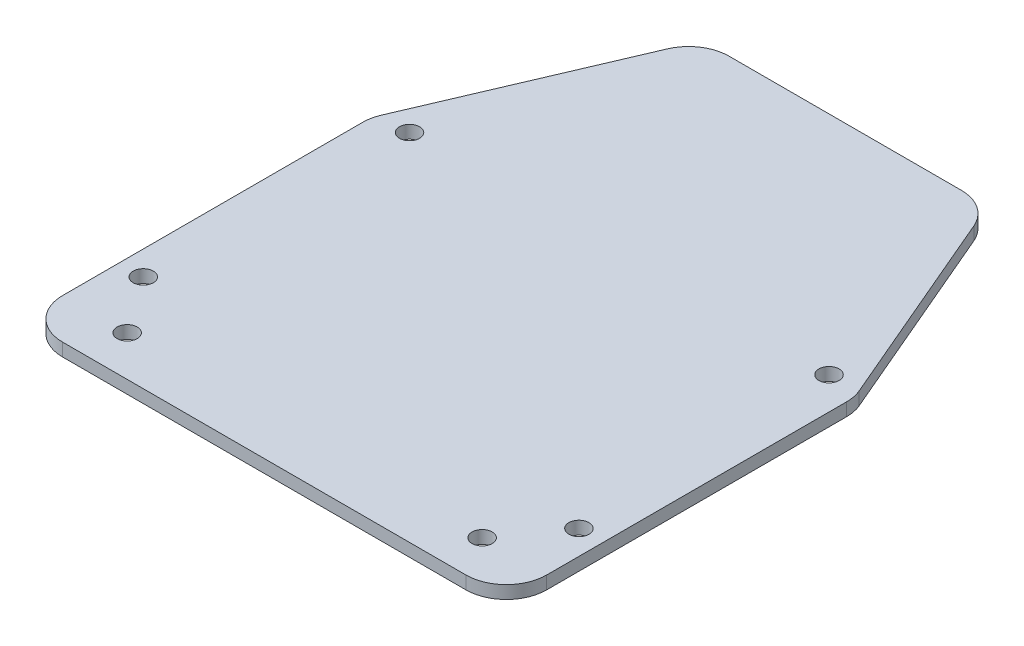
ISO-10303-21;
HEADER;
FILE_DESCRIPTION(('STEP AP214'),'2;1');
FILE_NAME('part.step','',(''),(''),'','','');
FILE_SCHEMA(('AUTOMOTIVE_DESIGN { 1 0 10303 214 1 1 1 1 }'));
ENDSEC;
DATA;
#1=APPLICATION_CONTEXT('core data for automotive mechanical design processes');
#2=APPLICATION_PROTOCOL_DEFINITION('international standard','automotive_design',2000,#1);
#3=PRODUCT_CONTEXT('',#1,'mechanical');
#4=PRODUCT('Part','Part','',(#3));
#5=PRODUCT_RELATED_PRODUCT_CATEGORY('part','',(#4));
#6=PRODUCT_DEFINITION_FORMATION('','',#4);
#7=PRODUCT_DEFINITION_CONTEXT('part definition',#1,'design');
#8=PRODUCT_DEFINITION('design','',#6,#7);
#9=PRODUCT_DEFINITION_SHAPE('','',#8);
#10=(LENGTH_UNIT() NAMED_UNIT(*) SI_UNIT(.MILLI.,.METRE.));
#11=(NAMED_UNIT(*) PLANE_ANGLE_UNIT() SI_UNIT($,.RADIAN.));
#12=(NAMED_UNIT(*) SI_UNIT($,.STERADIAN.) SOLID_ANGLE_UNIT());
#13=UNCERTAINTY_MEASURE_WITH_UNIT(LENGTH_MEASURE(1.E-05),#10,'distance_accuracy_value','');
#14=(GEOMETRIC_REPRESENTATION_CONTEXT(3) GLOBAL_UNCERTAINTY_ASSIGNED_CONTEXT((#13)) GLOBAL_UNIT_ASSIGNED_CONTEXT((#10,
#11,#12)) REPRESENTATION_CONTEXT('',''));
#15=CARTESIAN_POINT('',(0.,0.,0.));
#16=DIRECTION('',(0.,0.,1.));
#17=DIRECTION('',(1.,0.,0.));
#18=AXIS2_PLACEMENT_3D('',#15,#16,#17);
#19=CARTESIAN_POINT('',(27.9727631458199,1.6,-11.9467009268606));
#20=DIRECTION('',(0.919639798457049,0.,-0.392762830591031));
#21=DIRECTION('',(-0.392762830591031,0.,-0.919639798457049));
#22=AXIS2_PLACEMENT_3D('',#19,#20,#21);
#23=PLANE('',#22);
#24=DIRECTION('',(0.392762830591031,0.,0.919639798457049));
#25=VECTOR('',#24,1.);
#26=CARTESIAN_POINT('',(27.9727631458199,1.6,-11.9467009268606));
#27=LINE('',#26,#25);
#28=CARTESIAN_POINT('',(18.9967043721754,1.6,-32.9638141529552));
#29=VERTEX_POINT('',#28);
#30=CARTESIAN_POINT('',(29.5981989922852,1.6,-8.14080235952723));
#31=VERTEX_POINT('',#30);
#32=EDGE_CURVE('E213',#29,#31,#27,.T.);
#33=ORIENTED_EDGE('',*,*,#32,.T.);
#34=DIRECTION('',(0.,-1.,0.));
#35=VECTOR('',#34,1.);
#36=CARTESIAN_POINT('',(29.5981989922852,0.,-8.14080235952724));
#37=LINE('',#36,#35);
#38=CARTESIAN_POINT('',(29.5981989922852,0.,-8.14080235952723));
#39=VERTEX_POINT('',#38);
#40=EDGE_CURVE('E150',#31,#39,#37,.T.);
#41=ORIENTED_EDGE('',*,*,#40,.T.);
#42=DIRECTION('',(0.392762830591031,0.,0.919639798457049));
#43=VECTOR('',#42,1.);
#44=CARTESIAN_POINT('',(27.9727631458199,0.,-11.9467009268606));
#45=LINE('',#44,#43);
#46=CARTESIAN_POINT('',(18.9967043721754,0.,-32.9638141529552));
#47=VERTEX_POINT('',#46);
#48=EDGE_CURVE('E135',#47,#39,#45,.T.);
#49=ORIENTED_EDGE('',*,*,#48,.F.);
#50=DIRECTION('',(0.,-1.,0.));
#51=VECTOR('',#50,1.);
#52=CARTESIAN_POINT('',(18.9967043721754,1.6,-32.9638141529551));
#53=LINE('',#52,#51);
#54=EDGE_CURVE('E147',#47,#29,#53,.F.);
#55=ORIENTED_EDGE('',*,*,#54,.T.);
#56=EDGE_LOOP('',(#33,#41,#49,#55));
#57=FACE_BOUND('',#56,.T.);
#58=ADVANCED_FACE('F41',(#57),#23,.T.);
#59=CARTESIAN_POINT('',(0.,1.6,-36.));
#60=DIRECTION('',(0.,0.,-1.));
#61=DIRECTION('',(-1.,0.,0.));
#62=AXIS2_PLACEMENT_3D('',#59,#60,#61);
#63=PLANE('',#62);
#64=DIRECTION('',(1.,0.,0.));
#65=VECTOR('',#64,1.);
#66=CARTESIAN_POINT('',(0.,1.6,-36.));
#67=LINE('',#66,#65);
#68=CARTESIAN_POINT('',(-14.3985053798902,1.6,-36.));
#69=VERTEX_POINT('',#68);
#70=CARTESIAN_POINT('',(14.3985053798902,1.6,-36.));
#71=VERTEX_POINT('',#70);
#72=EDGE_CURVE('E206',#69,#71,#67,.T.);
#73=ORIENTED_EDGE('',*,*,#72,.T.);
#74=DIRECTION('',(0.,-1.,0.));
#75=VECTOR('',#74,1.);
#76=CARTESIAN_POINT('',(14.3985053798902,1.6,-36.));
#77=LINE('',#76,#75);
#78=CARTESIAN_POINT('',(14.3985053798902,0.,-36.));
#79=VERTEX_POINT('',#78);
#80=EDGE_CURVE('E11',#71,#79,#77,.T.);
#81=ORIENTED_EDGE('',*,*,#80,.T.);
#82=DIRECTION('',(1.,0.,0.));
#83=VECTOR('',#82,1.);
#84=CARTESIAN_POINT('',(0.,0.,-36.));
#85=LINE('',#84,#83);
#86=CARTESIAN_POINT('',(-14.3985053798902,0.,-36.));
#87=VERTEX_POINT('',#86);
#88=EDGE_CURVE('E137',#87,#79,#85,.T.);
#89=ORIENTED_EDGE('',*,*,#88,.F.);
#90=DIRECTION('',(0.,-1.,0.));
#91=VECTOR('',#90,1.);
#92=CARTESIAN_POINT('',(-14.3985053798902,1.6,-36.));
#93=LINE('',#92,#91);
#94=EDGE_CURVE('E49',#87,#69,#93,.F.);
#95=ORIENTED_EDGE('',*,*,#94,.T.);
#96=EDGE_LOOP('',(#73,#81,#89,#95));
#97=FACE_BOUND('',#96,.T.);
#98=ADVANCED_FACE('F205',(#97),#63,.T.);
#99=CARTESIAN_POINT('',(-27.9727631458199,1.6,-11.9467009268606));
#100=DIRECTION('',(0.919639798457049,0.,0.392762830591031));
#101=DIRECTION('',(0.392762830591031,0.,-0.919639798457049));
#102=AXIS2_PLACEMENT_3D('',#99,#100,#101);
#103=PLANE('',#102);
#104=DIRECTION('',(-0.392762830591031,0.,0.919639798457049));
#105=VECTOR('',#104,1.);
#106=CARTESIAN_POINT('',(-27.9727631458199,0.,-11.9467009268606));
#107=LINE('',#106,#105);
#108=CARTESIAN_POINT('',(-18.9967043721754,0.,-32.9638141529552));
#109=VERTEX_POINT('',#108);
#110=CARTESIAN_POINT('',(-29.5981989922852,0.,-8.14080235952724));
#111=VERTEX_POINT('',#110);
#112=EDGE_CURVE('E220',#109,#111,#107,.T.);
#113=ORIENTED_EDGE('',*,*,#112,.T.);
#114=DIRECTION('',(0.,-1.,0.));
#115=VECTOR('',#114,1.);
#116=CARTESIAN_POINT('',(-29.5981989922852,1.6,-8.14080235952724));
#117=LINE('',#116,#115);
#118=CARTESIAN_POINT('',(-29.5981989922852,1.6,-8.14080235952724));
#119=VERTEX_POINT('',#118);
#120=EDGE_CURVE('E200',#111,#119,#117,.F.);
#121=ORIENTED_EDGE('',*,*,#120,.T.);
#122=DIRECTION('',(-0.392762830591031,0.,0.919639798457049));
#123=VECTOR('',#122,1.);
#124=CARTESIAN_POINT('',(-27.9727631458199,1.6,-11.9467009268606));
#125=LINE('',#124,#123);
#126=CARTESIAN_POINT('',(-18.9967043721754,1.6,-32.9638141529552));
#127=VERTEX_POINT('',#126);
#128=EDGE_CURVE('E212',#127,#119,#125,.T.);
#129=ORIENTED_EDGE('',*,*,#128,.F.);
#130=DIRECTION('',(0.,-1.,0.));
#131=VECTOR('',#130,1.);
#132=CARTESIAN_POINT('',(-18.9967043721754,0.,-32.9638141529551));
#133=LINE('',#132,#131);
#134=EDGE_CURVE('E197',#127,#109,#133,.T.);
#135=ORIENTED_EDGE('',*,*,#134,.T.);
#136=EDGE_LOOP('',(#113,#121,#129,#135));
#137=FACE_BOUND('',#136,.T.);
#138=ADVANCED_FACE('F219',(#137),#103,.F.);
#139=CARTESIAN_POINT('',(-30.,1.6,0.));
#140=DIRECTION('',(-1.,0.,0.));
#141=DIRECTION('',(0.,0.,1.));
#142=AXIS2_PLACEMENT_3D('',#139,#140,#141);
#143=PLANE('',#142);
#144=DIRECTION('',(0.,0.,-1.));
#145=VECTOR('',#144,1.);
#146=CARTESIAN_POINT('',(-30.,0.,0.));
#147=LINE('',#146,#145);
#148=CARTESIAN_POINT('',(-30.,0.,31.));
#149=VERTEX_POINT('',#148);
#150=CARTESIAN_POINT('',(-30.,0.,-6.17698820657208));
#151=VERTEX_POINT('',#150);
#152=EDGE_CURVE('E223',#149,#151,#147,.T.);
#153=ORIENTED_EDGE('',*,*,#152,.F.);
#154=DIRECTION('',(0.,-1.,0.));
#155=VECTOR('',#154,1.);
#156=CARTESIAN_POINT('',(-30.,1.6,31.));
#157=LINE('',#156,#155);
#158=CARTESIAN_POINT('',(-30.,1.6,31.));
#159=VERTEX_POINT('',#158);
#160=EDGE_CURVE('E195',#149,#159,#157,.F.);
#161=ORIENTED_EDGE('',*,*,#160,.T.);
#162=DIRECTION('',(0.,0.,-1.));
#163=VECTOR('',#162,1.);
#164=CARTESIAN_POINT('',(-30.,1.6,0.));
#165=LINE('',#164,#163);
#166=CARTESIAN_POINT('',(-30.,1.6,-6.17698820657208));
#167=VERTEX_POINT('',#166);
#168=EDGE_CURVE('E454',#159,#167,#165,.T.);
#169=ORIENTED_EDGE('',*,*,#168,.T.);
#170=DIRECTION('',(0.,-1.,0.));
#171=VECTOR('',#170,1.);
#172=CARTESIAN_POINT('',(-30.,0.,-6.17698820657208));
#173=LINE('',#172,#171);
#174=EDGE_CURVE('E192',#167,#151,#173,.T.);
#175=ORIENTED_EDGE('',*,*,#174,.T.);
#176=EDGE_LOOP('',(#153,#161,#169,#175));
#177=FACE_BOUND('',#176,.T.);
#178=ADVANCED_FACE('F364',(#177),#143,.T.);
#179=CARTESIAN_POINT('',(0.,1.6,36.));
#180=DIRECTION('',(0.,0.,-1.));
#181=DIRECTION('',(-1.,0.,0.));
#182=AXIS2_PLACEMENT_3D('',#179,#180,#181);
#183=PLANE('',#182);
#184=DIRECTION('',(1.,0.,0.));
#185=VECTOR('',#184,1.);
#186=CARTESIAN_POINT('',(0.,0.,36.));
#187=LINE('',#186,#185);
#188=CARTESIAN_POINT('',(-25.,0.,36.));
#189=VERTEX_POINT('',#188);
#190=CARTESIAN_POINT('',(25.,0.,36.));
#191=VERTEX_POINT('',#190);
#192=EDGE_CURVE('E225',#189,#191,#187,.T.);
#193=ORIENTED_EDGE('',*,*,#192,.T.);
#194=DIRECTION('',(0.,-1.,0.));
#195=VECTOR('',#194,1.);
#196=CARTESIAN_POINT('',(25.,1.6,36.));
#197=LINE('',#196,#195);
#198=CARTESIAN_POINT('',(25.,1.6,36.));
#199=VERTEX_POINT('',#198);
#200=EDGE_CURVE('E56',#191,#199,#197,.F.);
#201=ORIENTED_EDGE('',*,*,#200,.T.);
#202=DIRECTION('',(1.,0.,0.));
#203=VECTOR('',#202,1.);
#204=CARTESIAN_POINT('',(0.,1.6,36.));
#205=LINE('',#204,#203);
#206=CARTESIAN_POINT('',(-25.,1.6,36.));
#207=VERTEX_POINT('',#206);
#208=EDGE_CURVE('E160',#207,#199,#205,.T.);
#209=ORIENTED_EDGE('',*,*,#208,.F.);
#210=DIRECTION('',(0.,-1.,0.));
#211=VECTOR('',#210,1.);
#212=CARTESIAN_POINT('',(-25.,0.,36.));
#213=LINE('',#212,#211);
#214=EDGE_CURVE('E188',#207,#189,#213,.T.);
#215=ORIENTED_EDGE('',*,*,#214,.T.);
#216=EDGE_LOOP('',(#193,#201,#209,#215));
#217=FACE_BOUND('',#216,.T.);
#218=ADVANCED_FACE('F354',(#217),#183,.F.);
#219=CARTESIAN_POINT('',(30.,1.6,0.));
#220=DIRECTION('',(-1.,0.,0.));
#221=DIRECTION('',(0.,0.,1.));
#222=AXIS2_PLACEMENT_3D('',#219,#220,#221);
#223=PLANE('',#222);
#224=DIRECTION('',(0.,0.,-1.));
#225=VECTOR('',#224,1.);
#226=CARTESIAN_POINT('',(30.,0.,0.));
#227=LINE('',#226,#225);
#228=CARTESIAN_POINT('',(30.,0.,31.));
#229=VERTEX_POINT('',#228);
#230=CARTESIAN_POINT('',(30.,0.,-6.17698820657208));
#231=VERTEX_POINT('',#230);
#232=EDGE_CURVE('E230',#229,#231,#227,.T.);
#233=ORIENTED_EDGE('',*,*,#232,.T.);
#234=DIRECTION('',(0.,-1.,0.));
#235=VECTOR('',#234,1.);
#236=CARTESIAN_POINT('',(30.,1.6,-6.17698820657208));
#237=LINE('',#236,#235);
#238=CARTESIAN_POINT('',(30.,1.6,-6.17698820657208));
#239=VERTEX_POINT('',#238);
#240=EDGE_CURVE('E176',#231,#239,#237,.F.);
#241=ORIENTED_EDGE('',*,*,#240,.T.);
#242=DIRECTION('',(0.,0.,-1.));
#243=VECTOR('',#242,1.);
#244=CARTESIAN_POINT('',(30.,1.6,0.));
#245=LINE('',#244,#243);
#246=CARTESIAN_POINT('',(30.,1.6,31.));
#247=VERTEX_POINT('',#246);
#248=EDGE_CURVE('E156',#247,#239,#245,.T.);
#249=ORIENTED_EDGE('',*,*,#248,.F.);
#250=DIRECTION('',(0.,-1.,0.));
#251=VECTOR('',#250,1.);
#252=CARTESIAN_POINT('',(30.,1.6,31.));
#253=LINE('',#252,#251);
#254=EDGE_CURVE('E173',#247,#229,#253,.T.);
#255=ORIENTED_EDGE('',*,*,#254,.T.);
#256=EDGE_LOOP('',(#233,#241,#249,#255));
#257=FACE_BOUND('',#256,.T.);
#258=ADVANCED_FACE('F344',(#257),#223,.F.);
#259=CARTESIAN_POINT('',(0.,1.6,0.));
#260=DIRECTION('',(0.,1.,0.));
#261=DIRECTION('',(0.,0.,1.));
#262=AXIS2_PLACEMENT_3D('',#259,#260,#261);
#263=PLANE('',#262);
#264=CARTESIAN_POINT('',(27.,1.6,24.));
#265=DIRECTION('',(0.,1.,0.));
#266=DIRECTION('',(0.,0.,1.));
#267=AXIS2_PLACEMENT_3D('',#264,#265,#266);
#268=CIRCLE('',#267,1.25);
#269=CARTESIAN_POINT('',(27.,1.6,25.25));
#270=VERTEX_POINT('',#269);
#271=EDGE_CURVE('E444',#270,#270,#268,.T.);
#272=ORIENTED_EDGE('',*,*,#271,.F.);
#273=EDGE_LOOP('',(#272));
#274=FACE_BOUND('',#273,.T.);
#275=CARTESIAN_POINT('',(26.,1.6,-7.99999999999999));
#276=DIRECTION('',(0.,1.,0.));
#277=DIRECTION('',(0.,0.,1.));
#278=AXIS2_PLACEMENT_3D('',#275,#276,#277);
#279=CIRCLE('',#278,1.25);
#280=CARTESIAN_POINT('',(26.,1.6,-6.74999999999999));
#281=VERTEX_POINT('',#280);
#282=EDGE_CURVE('E446',#281,#281,#279,.T.);
#283=ORIENTED_EDGE('',*,*,#282,.F.);
#284=EDGE_LOOP('',(#283));
#285=FACE_BOUND('',#284,.T.);
#286=CARTESIAN_POINT('',(-26.,1.6,-7.99999999999999));
#287=DIRECTION('',(0.,1.,0.));
#288=DIRECTION('',(0.,0.,1.));
#289=AXIS2_PLACEMENT_3D('',#286,#287,#288);
#290=CIRCLE('',#289,1.25);
#291=CARTESIAN_POINT('',(-26.,1.6,-6.74999999999999));
#292=VERTEX_POINT('',#291);
#293=EDGE_CURVE('E470',#292,#292,#290,.T.);
#294=ORIENTED_EDGE('',*,*,#293,.F.);
#295=EDGE_LOOP('',(#294));
#296=FACE_BOUND('',#295,.T.);
#297=CARTESIAN_POINT('',(-22.,1.6,31.));
#298=DIRECTION('',(0.,1.,0.));
#299=DIRECTION('',(0.,0.,1.));
#300=AXIS2_PLACEMENT_3D('',#297,#298,#299);
#301=CIRCLE('',#300,1.25);
#302=CARTESIAN_POINT('',(-22.,1.6,32.25));
#303=VERTEX_POINT('',#302);
#304=EDGE_CURVE('E450',#303,#303,#301,.T.);
#305=ORIENTED_EDGE('',*,*,#304,.F.);
#306=EDGE_LOOP('',(#305));
#307=FACE_BOUND('',#306,.T.);
#308=CARTESIAN_POINT('',(22.,1.6,31.));
#309=DIRECTION('',(0.,1.,0.));
#310=DIRECTION('',(0.,0.,1.));
#311=AXIS2_PLACEMENT_3D('',#308,#309,#310);
#312=CIRCLE('',#311,1.25);
#313=CARTESIAN_POINT('',(22.,1.6,32.25));
#314=VERTEX_POINT('',#313);
#315=EDGE_CURVE('E471',#314,#314,#312,.T.);
#316=ORIENTED_EDGE('',*,*,#315,.F.);
#317=EDGE_LOOP('',(#316));
#318=FACE_BOUND('',#317,.T.);
#319=CARTESIAN_POINT('',(-27.,1.6,24.));
#320=DIRECTION('',(0.,1.,0.));
#321=DIRECTION('',(0.,0.,1.));
#322=AXIS2_PLACEMENT_3D('',#319,#320,#321);
#323=CIRCLE('',#322,1.25);
#324=CARTESIAN_POINT('',(-27.,1.6,25.25));
#325=VERTEX_POINT('',#324);
#326=EDGE_CURVE('E237',#325,#325,#323,.T.);
#327=ORIENTED_EDGE('',*,*,#326,.F.);
#328=EDGE_LOOP('',(#327));
#329=FACE_BOUND('',#328,.T.);
#330=ORIENTED_EDGE('',*,*,#248,.T.);
#331=CARTESIAN_POINT('',(25.,1.6,-6.17698820657208));
#332=DIRECTION('',(0.,1.,0.));
#333=DIRECTION('',(0.,0.,1.));
#334=AXIS2_PLACEMENT_3D('',#331,#332,#333);
#335=CIRCLE('',#334,5.);
#336=EDGE_CURVE('E186',#239,#31,#335,.T.);
#337=ORIENTED_EDGE('',*,*,#336,.T.);
#338=ORIENTED_EDGE('',*,*,#32,.F.);
#339=CARTESIAN_POINT('',(14.3985053798902,1.6,-31.));
#340=DIRECTION('',(0.,1.,0.));
#341=DIRECTION('',(0.,0.,1.));
#342=AXIS2_PLACEMENT_3D('',#339,#340,#341);
#343=CIRCLE('',#342,5.);
#344=EDGE_CURVE('E155',#29,#71,#343,.T.);
#345=ORIENTED_EDGE('',*,*,#344,.T.);
#346=ORIENTED_EDGE('',*,*,#72,.F.);
#347=CARTESIAN_POINT('',(-14.3985053798902,1.6,-31.));
#348=DIRECTION('',(0.,1.,0.));
#349=DIRECTION('',(0.,0.,1.));
#350=AXIS2_PLACEMENT_3D('',#347,#348,#349);
#351=CIRCLE('',#350,5.);
#352=EDGE_CURVE('E178',#69,#127,#351,.T.);
#353=ORIENTED_EDGE('',*,*,#352,.T.);
#354=ORIENTED_EDGE('',*,*,#128,.T.);
#355=CARTESIAN_POINT('',(-25.,1.6,-6.17698820657208));
#356=DIRECTION('',(0.,1.,0.));
#357=DIRECTION('',(0.,0.,1.));
#358=AXIS2_PLACEMENT_3D('',#355,#356,#357);
#359=CIRCLE('',#358,5.);
#360=EDGE_CURVE('E181',#119,#167,#359,.T.);
#361=ORIENTED_EDGE('',*,*,#360,.T.);
#362=ORIENTED_EDGE('',*,*,#168,.F.);
#363=CARTESIAN_POINT('',(-25.,1.6,31.));
#364=DIRECTION('',(0.,1.,0.));
#365=DIRECTION('',(0.,0.,1.));
#366=AXIS2_PLACEMENT_3D('',#363,#364,#365);
#367=CIRCLE('',#366,5.);
#368=EDGE_CURVE('E63',#159,#207,#367,.T.);
#369=ORIENTED_EDGE('',*,*,#368,.T.);
#370=ORIENTED_EDGE('',*,*,#208,.T.);
#371=CARTESIAN_POINT('',(25.,1.6,31.));
#372=DIRECTION('',(0.,1.,0.));
#373=DIRECTION('',(0.,0.,1.));
#374=AXIS2_PLACEMENT_3D('',#371,#372,#373);
#375=CIRCLE('',#374,5.);
#376=EDGE_CURVE('E184',#199,#247,#375,.T.);
#377=ORIENTED_EDGE('',*,*,#376,.T.);
#378=EDGE_LOOP('',(#330,#337,#338,#345,#346,#353,#354,#361,#362,#369,#370,#377));
#379=FACE_BOUND('',#378,.T.);
#380=ADVANCED_FACE('F209',(#274,#285,#296,#307,#318,#329,#379),#263,.T.);
#381=CARTESIAN_POINT('',(0.,0.,0.));
#382=DIRECTION('',(0.,1.,0.));
#383=DIRECTION('',(0.,0.,1.));
#384=AXIS2_PLACEMENT_3D('',#381,#382,#383);
#385=PLANE('',#384);
#386=CARTESIAN_POINT('',(27.,0.,24.));
#387=DIRECTION('',(0.,1.,0.));
#388=DIRECTION('',(0.,0.,1.));
#389=AXIS2_PLACEMENT_3D('',#386,#387,#388);
#390=CIRCLE('',#389,1.25);
#391=CARTESIAN_POINT('',(27.,0.,25.25));
#392=VERTEX_POINT('',#391);
#393=EDGE_CURVE('E151',#392,#392,#390,.T.);
#394=ORIENTED_EDGE('',*,*,#393,.T.);
#395=EDGE_LOOP('',(#394));
#396=FACE_BOUND('',#395,.T.);
#397=CARTESIAN_POINT('',(26.,0.,-7.99999999999999));
#398=DIRECTION('',(0.,1.,0.));
#399=DIRECTION('',(0.,0.,1.));
#400=AXIS2_PLACEMENT_3D('',#397,#398,#399);
#401=CIRCLE('',#400,1.25);
#402=CARTESIAN_POINT('',(26.,0.,-6.74999999999999));
#403=VERTEX_POINT('',#402);
#404=EDGE_CURVE('E245',#403,#403,#401,.T.);
#405=ORIENTED_EDGE('',*,*,#404,.T.);
#406=EDGE_LOOP('',(#405));
#407=FACE_BOUND('',#406,.T.);
#408=CARTESIAN_POINT('',(-26.,0.,-7.99999999999999));
#409=DIRECTION('',(0.,1.,0.));
#410=DIRECTION('',(0.,0.,1.));
#411=AXIS2_PLACEMENT_3D('',#408,#409,#410);
#412=CIRCLE('',#411,1.25);
#413=CARTESIAN_POINT('',(-26.,0.,-6.74999999999999));
#414=VERTEX_POINT('',#413);
#415=EDGE_CURVE('E243',#414,#414,#412,.T.);
#416=ORIENTED_EDGE('',*,*,#415,.T.);
#417=EDGE_LOOP('',(#416));
#418=FACE_BOUND('',#417,.T.);
#419=CARTESIAN_POINT('',(-22.,0.,31.));
#420=DIRECTION('',(0.,1.,0.));
#421=DIRECTION('',(0.,0.,1.));
#422=AXIS2_PLACEMENT_3D('',#419,#420,#421);
#423=CIRCLE('',#422,1.25);
#424=CARTESIAN_POINT('',(-22.,0.,32.25));
#425=VERTEX_POINT('',#424);
#426=EDGE_CURVE('E240',#425,#425,#423,.T.);
#427=ORIENTED_EDGE('',*,*,#426,.T.);
#428=EDGE_LOOP('',(#427));
#429=FACE_BOUND('',#428,.T.);
#430=CARTESIAN_POINT('',(22.,0.,31.));
#431=DIRECTION('',(0.,1.,0.));
#432=DIRECTION('',(0.,0.,1.));
#433=AXIS2_PLACEMENT_3D('',#430,#431,#432);
#434=CIRCLE('',#433,1.25);
#435=CARTESIAN_POINT('',(22.,0.,32.25));
#436=VERTEX_POINT('',#435);
#437=EDGE_CURVE('E236',#436,#436,#434,.T.);
#438=ORIENTED_EDGE('',*,*,#437,.T.);
#439=EDGE_LOOP('',(#438));
#440=FACE_BOUND('',#439,.T.);
#441=CARTESIAN_POINT('',(-27.,0.,24.));
#442=DIRECTION('',(0.,1.,0.));
#443=DIRECTION('',(0.,0.,1.));
#444=AXIS2_PLACEMENT_3D('',#441,#442,#443);
#445=CIRCLE('',#444,1.25);
#446=CARTESIAN_POINT('',(-27.,0.,25.25));
#447=VERTEX_POINT('',#446);
#448=EDGE_CURVE('E233',#447,#447,#445,.T.);
#449=ORIENTED_EDGE('',*,*,#448,.T.);
#450=EDGE_LOOP('',(#449));
#451=FACE_BOUND('',#450,.T.);
#452=ORIENTED_EDGE('',*,*,#48,.T.);
#453=CARTESIAN_POINT('',(25.,0.,-6.17698820657208));
#454=DIRECTION('',(0.,1.,0.));
#455=DIRECTION('',(0.,0.,1.));
#456=AXIS2_PLACEMENT_3D('',#453,#454,#455);
#457=CIRCLE('',#456,5.);
#458=EDGE_CURVE('E171',#39,#231,#457,.F.);
#459=ORIENTED_EDGE('',*,*,#458,.T.);
#460=ORIENTED_EDGE('',*,*,#232,.F.);
#461=CARTESIAN_POINT('',(25.,0.,31.));
#462=DIRECTION('',(0.,1.,0.));
#463=DIRECTION('',(0.,0.,1.));
#464=AXIS2_PLACEMENT_3D('',#461,#462,#463);
#465=CIRCLE('',#464,5.);
#466=EDGE_CURVE('E169',#229,#191,#465,.F.);
#467=ORIENTED_EDGE('',*,*,#466,.T.);
#468=ORIENTED_EDGE('',*,*,#192,.F.);
#469=CARTESIAN_POINT('',(-25.,0.,31.));
#470=DIRECTION('',(0.,1.,0.));
#471=DIRECTION('',(0.,0.,1.));
#472=AXIS2_PLACEMENT_3D('',#469,#470,#471);
#473=CIRCLE('',#472,5.);
#474=EDGE_CURVE('E167',#189,#149,#473,.F.);
#475=ORIENTED_EDGE('',*,*,#474,.T.);
#476=ORIENTED_EDGE('',*,*,#152,.T.);
#477=CARTESIAN_POINT('',(-25.,0.,-6.17698820657208));
#478=DIRECTION('',(0.,1.,0.));
#479=DIRECTION('',(0.,0.,1.));
#480=AXIS2_PLACEMENT_3D('',#477,#478,#479);
#481=CIRCLE('',#480,5.);
#482=EDGE_CURVE('E141',#151,#111,#481,.F.);
#483=ORIENTED_EDGE('',*,*,#482,.T.);
#484=ORIENTED_EDGE('',*,*,#112,.F.);
#485=CARTESIAN_POINT('',(-14.3985053798902,0.,-31.));
#486=DIRECTION('',(0.,1.,0.));
#487=DIRECTION('',(0.,0.,1.));
#488=AXIS2_PLACEMENT_3D('',#485,#486,#487);
#489=CIRCLE('',#488,5.);
#490=EDGE_CURVE('E142',#109,#87,#489,.F.);
#491=ORIENTED_EDGE('',*,*,#490,.T.);
#492=ORIENTED_EDGE('',*,*,#88,.T.);
#493=CARTESIAN_POINT('',(14.3985053798902,0.,-31.));
#494=DIRECTION('',(0.,1.,0.));
#495=DIRECTION('',(0.,0.,1.));
#496=AXIS2_PLACEMENT_3D('',#493,#494,#495);
#497=CIRCLE('',#496,5.);
#498=EDGE_CURVE('E132',#79,#47,#497,.F.);
#499=ORIENTED_EDGE('',*,*,#498,.T.);
#500=EDGE_LOOP('',(#452,#459,#460,#467,#468,#475,#476,#483,#484,#491,#492,#499));
#501=FACE_BOUND('',#500,.T.);
#502=ADVANCED_FACE('F134',(#396,#407,#418,#429,#440,#451,#501),#385,.F.);
#503=CARTESIAN_POINT('',(-27.,-0.9,24.));
#504=DIRECTION('',(0.,1.,0.));
#505=DIRECTION('',(0.,0.,1.));
#506=AXIS2_PLACEMENT_3D('',#503,#504,#505);
#507=CYLINDRICAL_SURFACE('',#506,1.25);
#508=ORIENTED_EDGE('',*,*,#326,.T.);
#509=EDGE_LOOP('',(#508));
#510=FACE_BOUND('',#509,.T.);
#511=ORIENTED_EDGE('',*,*,#448,.F.);
#512=EDGE_LOOP('',(#511));
#513=FACE_BOUND('',#512,.T.);
#514=ADVANCED_FACE('F333',(#510,#513),#507,.F.);
#515=CARTESIAN_POINT('',(22.,-0.9,31.));
#516=DIRECTION('',(0.,1.,0.));
#517=DIRECTION('',(0.,0.,1.));
#518=AXIS2_PLACEMENT_3D('',#515,#516,#517);
#519=CYLINDRICAL_SURFACE('',#518,1.25);
#520=ORIENTED_EDGE('',*,*,#315,.T.);
#521=EDGE_LOOP('',(#520));
#522=FACE_BOUND('',#521,.T.);
#523=ORIENTED_EDGE('',*,*,#437,.F.);
#524=EDGE_LOOP('',(#523));
#525=FACE_BOUND('',#524,.T.);
#526=ADVANCED_FACE('F418',(#522,#525),#519,.F.);
#527=CARTESIAN_POINT('',(-22.,-0.9,31.));
#528=DIRECTION('',(0.,1.,0.));
#529=DIRECTION('',(0.,0.,1.));
#530=AXIS2_PLACEMENT_3D('',#527,#528,#529);
#531=CYLINDRICAL_SURFACE('',#530,1.25);
#532=ORIENTED_EDGE('',*,*,#304,.T.);
#533=EDGE_LOOP('',(#532));
#534=FACE_BOUND('',#533,.T.);
#535=ORIENTED_EDGE('',*,*,#426,.F.);
#536=EDGE_LOOP('',(#535));
#537=FACE_BOUND('',#536,.T.);
#538=ADVANCED_FACE('F408',(#534,#537),#531,.F.);
#539=CARTESIAN_POINT('',(-26.,-0.9,-7.99999999999999));
#540=DIRECTION('',(0.,1.,0.));
#541=DIRECTION('',(0.,0.,1.));
#542=AXIS2_PLACEMENT_3D('',#539,#540,#541);
#543=CYLINDRICAL_SURFACE('',#542,1.25);
#544=ORIENTED_EDGE('',*,*,#293,.T.);
#545=EDGE_LOOP('',(#544));
#546=FACE_BOUND('',#545,.T.);
#547=ORIENTED_EDGE('',*,*,#415,.F.);
#548=EDGE_LOOP('',(#547));
#549=FACE_BOUND('',#548,.T.);
#550=ADVANCED_FACE('F266',(#546,#549),#543,.F.);
#551=CARTESIAN_POINT('',(26.,-0.9,-7.99999999999999));
#552=DIRECTION('',(0.,1.,0.));
#553=DIRECTION('',(0.,0.,1.));
#554=AXIS2_PLACEMENT_3D('',#551,#552,#553);
#555=CYLINDRICAL_SURFACE('',#554,1.25);
#556=ORIENTED_EDGE('',*,*,#282,.T.);
#557=EDGE_LOOP('',(#556));
#558=FACE_BOUND('',#557,.T.);
#559=ORIENTED_EDGE('',*,*,#404,.F.);
#560=EDGE_LOOP('',(#559));
#561=FACE_BOUND('',#560,.T.);
#562=ADVANCED_FACE('F256',(#558,#561),#555,.F.);
#563=CARTESIAN_POINT('',(27.,-0.9,24.));
#564=DIRECTION('',(0.,1.,0.));
#565=DIRECTION('',(0.,0.,1.));
#566=AXIS2_PLACEMENT_3D('',#563,#564,#565);
#567=CYLINDRICAL_SURFACE('',#566,1.25);
#568=ORIENTED_EDGE('',*,*,#271,.T.);
#569=EDGE_LOOP('',(#568));
#570=FACE_BOUND('',#569,.T.);
#571=ORIENTED_EDGE('',*,*,#393,.F.);
#572=EDGE_LOOP('',(#571));
#573=FACE_BOUND('',#572,.T.);
#574=ADVANCED_FACE('F253',(#570,#573),#567,.F.);
#575=CARTESIAN_POINT('',(25.,1.6,-6.17698820657208));
#576=DIRECTION('',(0.,1.,0.));
#577=DIRECTION('',(0.,0.,1.));
#578=AXIS2_PLACEMENT_3D('',#575,#576,#577);
#579=CYLINDRICAL_SURFACE('',#578,5.);
#580=ORIENTED_EDGE('',*,*,#336,.F.);
#581=ORIENTED_EDGE('',*,*,#240,.F.);
#582=ORIENTED_EDGE('',*,*,#458,.F.);
#583=ORIENTED_EDGE('',*,*,#40,.F.);
#584=EDGE_LOOP('',(#580,#581,#582,#583));
#585=FACE_BOUND('',#584,.T.);
#586=ADVANCED_FACE('F255',(#585),#579,.T.);
#587=CARTESIAN_POINT('',(25.,1.6,31.));
#588=DIRECTION('',(0.,-1.,0.));
#589=DIRECTION('',(0.,0.,-1.));
#590=AXIS2_PLACEMENT_3D('',#587,#588,#589);
#591=CYLINDRICAL_SURFACE('',#590,5.);
#592=ORIENTED_EDGE('',*,*,#376,.F.);
#593=ORIENTED_EDGE('',*,*,#200,.F.);
#594=ORIENTED_EDGE('',*,*,#466,.F.);
#595=ORIENTED_EDGE('',*,*,#254,.F.);
#596=EDGE_LOOP('',(#592,#593,#594,#595));
#597=FACE_BOUND('',#596,.T.);
#598=ADVANCED_FACE('F263',(#597),#591,.T.);
#599=CARTESIAN_POINT('',(-25.,1.6,31.));
#600=DIRECTION('',(0.,1.,0.));
#601=DIRECTION('',(0.,0.,1.));
#602=AXIS2_PLACEMENT_3D('',#599,#600,#601);
#603=CYLINDRICAL_SURFACE('',#602,5.);
#604=ORIENTED_EDGE('',*,*,#368,.F.);
#605=ORIENTED_EDGE('',*,*,#160,.F.);
#606=ORIENTED_EDGE('',*,*,#474,.F.);
#607=ORIENTED_EDGE('',*,*,#214,.F.);
#608=EDGE_LOOP('',(#604,#605,#606,#607));
#609=FACE_BOUND('',#608,.T.);
#610=ADVANCED_FACE('F281',(#609),#603,.T.);
#611=CARTESIAN_POINT('',(-25.,1.6,-6.17698820657208));
#612=DIRECTION('',(0.,1.,0.));
#613=DIRECTION('',(0.,0.,1.));
#614=AXIS2_PLACEMENT_3D('',#611,#612,#613);
#615=CYLINDRICAL_SURFACE('',#614,5.);
#616=ORIENTED_EDGE('',*,*,#360,.F.);
#617=ORIENTED_EDGE('',*,*,#120,.F.);
#618=ORIENTED_EDGE('',*,*,#482,.F.);
#619=ORIENTED_EDGE('',*,*,#174,.F.);
#620=EDGE_LOOP('',(#616,#617,#618,#619));
#621=FACE_BOUND('',#620,.T.);
#622=ADVANCED_FACE('F285',(#621),#615,.T.);
#623=CARTESIAN_POINT('',(14.3985053798902,1.6,-31.));
#624=DIRECTION('',(0.,-1.,0.));
#625=DIRECTION('',(0.,0.,-1.));
#626=AXIS2_PLACEMENT_3D('',#623,#624,#625);
#627=CYLINDRICAL_SURFACE('',#626,5.);
#628=ORIENTED_EDGE('',*,*,#344,.F.);
#629=ORIENTED_EDGE('',*,*,#54,.F.);
#630=ORIENTED_EDGE('',*,*,#498,.F.);
#631=ORIENTED_EDGE('',*,*,#80,.F.);
#632=EDGE_LOOP('',(#628,#629,#630,#631));
#633=FACE_BOUND('',#632,.T.);
#634=ADVANCED_FACE('F154',(#633),#627,.T.);
#635=CARTESIAN_POINT('',(-14.3985053798902,1.6,-31.));
#636=DIRECTION('',(0.,1.,0.));
#637=DIRECTION('',(0.,0.,1.));
#638=AXIS2_PLACEMENT_3D('',#635,#636,#637);
#639=CYLINDRICAL_SURFACE('',#638,5.);
#640=ORIENTED_EDGE('',*,*,#352,.F.);
#641=ORIENTED_EDGE('',*,*,#94,.F.);
#642=ORIENTED_EDGE('',*,*,#490,.F.);
#643=ORIENTED_EDGE('',*,*,#134,.F.);
#644=EDGE_LOOP('',(#640,#641,#642,#643));
#645=FACE_BOUND('',#644,.T.);
#646=ADVANCED_FACE('F43',(#645),#639,.T.);
#647=CLOSED_SHELL('',(#58,#98,#138,#178,#218,#258,#380,#502,#514,#526,#538,#550,#562,#574,#586,
#598,#610,#622,#634,#646));
#648=MANIFOLD_SOLID_BREP('B2',#647);
#649=ADVANCED_BREP_SHAPE_REPRESENTATION('',(#18,#648),#14);
#650=SHAPE_DEFINITION_REPRESENTATION(#9,#649);
ENDSEC;
END-ISO-10303-21;
